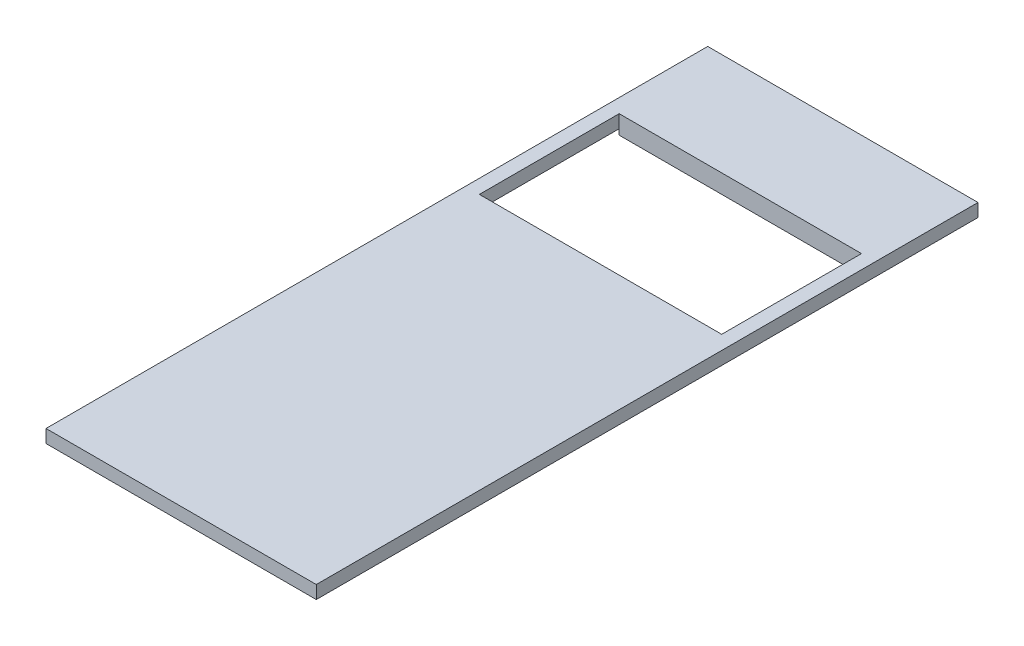
ISO-10303-21;
HEADER;
FILE_DESCRIPTION(('STEP AP214'),'2;1');
FILE_NAME('part.step','',(''),(''),'','','');
FILE_SCHEMA(('AUTOMOTIVE_DESIGN { 1 0 10303 214 1 1 1 1 }'));
ENDSEC;
DATA;
#1=APPLICATION_CONTEXT('core data for automotive mechanical design processes');
#2=APPLICATION_PROTOCOL_DEFINITION('international standard','automotive_design',2000,#1);
#3=PRODUCT_CONTEXT('',#1,'mechanical');
#4=PRODUCT('Part','Part','',(#3));
#5=PRODUCT_RELATED_PRODUCT_CATEGORY('part','',(#4));
#6=PRODUCT_DEFINITION_FORMATION('','',#4);
#7=PRODUCT_DEFINITION_CONTEXT('part definition',#1,'design');
#8=PRODUCT_DEFINITION('design','',#6,#7);
#9=PRODUCT_DEFINITION_SHAPE('','',#8);
#10=(LENGTH_UNIT() NAMED_UNIT(*) SI_UNIT(.MILLI.,.METRE.));
#11=(NAMED_UNIT(*) PLANE_ANGLE_UNIT() SI_UNIT($,.RADIAN.));
#12=(NAMED_UNIT(*) SI_UNIT($,.STERADIAN.) SOLID_ANGLE_UNIT());
#13=UNCERTAINTY_MEASURE_WITH_UNIT(LENGTH_MEASURE(1.E-05),#10,'distance_accuracy_value','');
#14=(GEOMETRIC_REPRESENTATION_CONTEXT(3) GLOBAL_UNCERTAINTY_ASSIGNED_CONTEXT((#13)) GLOBAL_UNIT_ASSIGNED_CONTEXT((#10,
#11,#12)) REPRESENTATION_CONTEXT('',''));
#15=CARTESIAN_POINT('',(0.,0.,0.));
#16=DIRECTION('',(0.,0.,1.));
#17=DIRECTION('',(1.,0.,0.));
#18=AXIS2_PLACEMENT_3D('',#15,#16,#17);
#19=CARTESIAN_POINT('',(1.5,10.9,-69.5));
#20=DIRECTION('',(-1.,0.,0.));
#21=DIRECTION('',(0.,0.,1.));
#22=AXIS2_PLACEMENT_3D('',#19,#20,#21);
#23=PLANE('',#22);
#24=DIRECTION('',(0.,-1.,0.));
#25=VECTOR('',#24,1.);
#26=CARTESIAN_POINT('',(1.49999999999999,26.3,-60.));
#27=LINE('',#26,#25);
#28=CARTESIAN_POINT('',(1.49999999999999,11.5,-60.));
#29=VERTEX_POINT('',#28);
#30=CARTESIAN_POINT('',(1.49999999999999,10.9,-60.));
#31=VERTEX_POINT('',#30);
#32=EDGE_CURVE('E259',#29,#31,#27,.T.);
#33=ORIENTED_EDGE('',*,*,#32,.F.);
#34=DIRECTION('',(0.,0.,1.));
#35=VECTOR('',#34,1.);
#36=CARTESIAN_POINT('',(1.5,11.5,-69.5));
#37=LINE('',#36,#35);
#38=CARTESIAN_POINT('',(1.5,11.5,-69.5));
#39=VERTEX_POINT('',#38);
#40=EDGE_CURVE('E177',#39,#29,#37,.T.);
#41=ORIENTED_EDGE('',*,*,#40,.F.);
#42=DIRECTION('',(0.,1.,0.));
#43=VECTOR('',#42,1.);
#44=CARTESIAN_POINT('',(1.5,10.9,-69.5));
#45=LINE('',#44,#43);
#46=CARTESIAN_POINT('',(1.5,10.9,-69.5));
#47=VERTEX_POINT('',#46);
#48=EDGE_CURVE('E11',#47,#39,#45,.T.);
#49=ORIENTED_EDGE('',*,*,#48,.F.);
#50=DIRECTION('',(0.,0.,1.));
#51=VECTOR('',#50,1.);
#52=CARTESIAN_POINT('',(1.5,10.9,-69.5));
#53=LINE('',#52,#51);
#54=EDGE_CURVE('E227',#47,#31,#53,.T.);
#55=ORIENTED_EDGE('',*,*,#54,.T.);
#56=EDGE_LOOP('',(#33,#41,#49,#55));
#57=FACE_BOUND('',#56,.T.);
#58=ADVANCED_FACE('F39',(#57),#23,.T.);
#59=CARTESIAN_POINT('',(27.5,10.9,-69.5));
#60=DIRECTION('',(1.,0.,0.));
#61=DIRECTION('',(0.,0.,-1.));
#62=AXIS2_PLACEMENT_3D('',#59,#60,#61);
#63=PLANE('',#62);
#64=DIRECTION('',(0.,-1.,0.));
#65=VECTOR('',#64,1.);
#66=CARTESIAN_POINT('',(27.5,26.3,-60.));
#67=LINE('',#66,#65);
#68=CARTESIAN_POINT('',(27.5,11.5,-60.));
#69=VERTEX_POINT('',#68);
#70=CARTESIAN_POINT('',(27.5,10.9,-60.));
#71=VERTEX_POINT('',#70);
#72=EDGE_CURVE('E254',#69,#71,#67,.T.);
#73=ORIENTED_EDGE('',*,*,#72,.T.);
#74=DIRECTION('',(0.,0.,-1.));
#75=VECTOR('',#74,1.);
#76=CARTESIAN_POINT('',(27.5,10.9,-69.5));
#77=LINE('',#76,#75);
#78=CARTESIAN_POINT('',(27.5,10.9,-69.5));
#79=VERTEX_POINT('',#78);
#80=EDGE_CURVE('E167',#71,#79,#77,.T.);
#81=ORIENTED_EDGE('',*,*,#80,.T.);
#82=DIRECTION('',(0.,1.,0.));
#83=VECTOR('',#82,1.);
#84=CARTESIAN_POINT('',(27.5,10.9,-69.5));
#85=LINE('',#84,#83);
#86=CARTESIAN_POINT('',(27.5,11.5,-69.5));
#87=VERTEX_POINT('',#86);
#88=EDGE_CURVE('E49',#79,#87,#85,.T.);
#89=ORIENTED_EDGE('',*,*,#88,.T.);
#90=DIRECTION('',(0.,0.,-1.));
#91=VECTOR('',#90,1.);
#92=CARTESIAN_POINT('',(27.5,11.5,-69.5));
#93=LINE('',#92,#91);
#94=EDGE_CURVE('E187',#69,#87,#93,.T.);
#95=ORIENTED_EDGE('',*,*,#94,.F.);
#96=EDGE_LOOP('',(#73,#81,#89,#95));
#97=FACE_BOUND('',#96,.T.);
#98=ADVANCED_FACE('F242',(#97),#63,.T.);
#99=CARTESIAN_POINT('',(0.,10.9,0.));
#100=DIRECTION('',(0.,1.,0.));
#101=DIRECTION('',(0.,0.,1.));
#102=AXIS2_PLACEMENT_3D('',#99,#100,#101);
#103=PLANE('',#102);
#104=ORIENTED_EDGE('',*,*,#80,.F.);
#105=DIRECTION('',(1.,0.,0.));
#106=VECTOR('',#105,1.);
#107=CARTESIAN_POINT('',(1.49999999999999,10.9,-60.));
#108=LINE('',#107,#106);
#109=EDGE_CURVE('E151',#31,#71,#108,.T.);
#110=ORIENTED_EDGE('',*,*,#109,.F.);
#111=ORIENTED_EDGE('',*,*,#54,.F.);
#112=DIRECTION('',(-1.,0.,0.));
#113=VECTOR('',#112,1.);
#114=CARTESIAN_POINT('',(1.5,10.9,-69.5));
#115=LINE('',#114,#113);
#116=EDGE_CURVE('E166',#79,#47,#115,.T.);
#117=ORIENTED_EDGE('',*,*,#116,.F.);
#118=EDGE_LOOP('',(#104,#110,#111,#117));
#119=FACE_BOUND('',#118,.T.);
#120=ADVANCED_FACE('F249',(#119),#103,.F.);
#121=DIRECTION('',(0.,-1.,0.));
#122=VECTOR('',#121,1.);
#123=CARTESIAN_POINT('',(1.49999999999999,26.3,-45.));
#124=LINE('',#123,#122);
#125=CARTESIAN_POINT('',(1.5,11.5,-45.));
#126=VERTEX_POINT('',#125);
#127=CARTESIAN_POINT('',(1.49999999999999,10.9,-45.));
#128=VERTEX_POINT('',#127);
#129=EDGE_CURVE('E262',#126,#128,#124,.T.);
#130=ORIENTED_EDGE('',*,*,#129,.T.);
#131=CARTESIAN_POINT('',(1.5,10.9,-1.5));
#132=VERTEX_POINT('',#131);
#133=EDGE_CURVE('E160',#128,#132,#53,.T.);
#134=ORIENTED_EDGE('',*,*,#133,.T.);
#135=DIRECTION('',(0.,1.,0.));
#136=VECTOR('',#135,1.);
#137=CARTESIAN_POINT('',(1.5,10.9,-1.5));
#138=LINE('',#137,#136);
#139=CARTESIAN_POINT('',(1.5,11.5,-1.5));
#140=VERTEX_POINT('',#139);
#141=EDGE_CURVE('E43',#132,#140,#138,.T.);
#142=ORIENTED_EDGE('',*,*,#141,.T.);
#143=EDGE_CURVE('E183',#126,#140,#37,.T.);
#144=ORIENTED_EDGE('',*,*,#143,.F.);
#145=EDGE_LOOP('',(#130,#134,#142,#144));
#146=FACE_BOUND('',#145,.T.);
#147=ADVANCED_FACE('F41',(#146),#23,.T.);
#148=CARTESIAN_POINT('',(1.5,10.9,-69.5));
#149=DIRECTION('',(0.,0.,-1.));
#150=DIRECTION('',(-1.,0.,0.));
#151=AXIS2_PLACEMENT_3D('',#148,#149,#150);
#152=PLANE('',#151);
#153=DIRECTION('',(-1.,0.,0.));
#154=VECTOR('',#153,1.);
#155=CARTESIAN_POINT('',(1.5,11.5,-69.5));
#156=LINE('',#155,#154);
#157=EDGE_CURVE('E191',#87,#39,#156,.T.);
#158=ORIENTED_EDGE('',*,*,#157,.F.);
#159=ORIENTED_EDGE('',*,*,#88,.F.);
#160=ORIENTED_EDGE('',*,*,#116,.T.);
#161=ORIENTED_EDGE('',*,*,#48,.T.);
#162=EDGE_LOOP('',(#158,#159,#160,#161));
#163=FACE_BOUND('',#162,.T.);
#164=ADVANCED_FACE('F246',(#163),#152,.T.);
#165=DIRECTION('',(0.,-1.,0.));
#166=VECTOR('',#165,1.);
#167=CARTESIAN_POINT('',(27.5,26.3,-45.));
#168=LINE('',#167,#166);
#169=CARTESIAN_POINT('',(27.5,11.5,-45.));
#170=VERTEX_POINT('',#169);
#171=CARTESIAN_POINT('',(27.5,10.9,-45.));
#172=VERTEX_POINT('',#171);
#173=EDGE_CURVE('E139',#170,#172,#168,.T.);
#174=ORIENTED_EDGE('',*,*,#173,.F.);
#175=CARTESIAN_POINT('',(27.5,11.5,-1.5));
#176=VERTEX_POINT('',#175);
#177=EDGE_CURVE('E188',#176,#170,#93,.T.);
#178=ORIENTED_EDGE('',*,*,#177,.F.);
#179=DIRECTION('',(0.,1.,0.));
#180=VECTOR('',#179,1.);
#181=CARTESIAN_POINT('',(27.5,10.9,-1.5));
#182=LINE('',#181,#180);
#183=CARTESIAN_POINT('',(27.5,10.9,-1.5));
#184=VERTEX_POINT('',#183);
#185=EDGE_CURVE('E164',#184,#176,#182,.T.);
#186=ORIENTED_EDGE('',*,*,#185,.F.);
#187=EDGE_CURVE('E158',#184,#172,#77,.T.);
#188=ORIENTED_EDGE('',*,*,#187,.T.);
#189=EDGE_LOOP('',(#174,#178,#186,#188));
#190=FACE_BOUND('',#189,.T.);
#191=ADVANCED_FACE('F163',(#190),#63,.T.);
#192=CARTESIAN_POINT('',(1.5,10.9,-1.5));
#193=DIRECTION('',(0.,0.,1.));
#194=DIRECTION('',(1.,0.,0.));
#195=AXIS2_PLACEMENT_3D('',#192,#193,#194);
#196=PLANE('',#195);
#197=DIRECTION('',(1.,0.,0.));
#198=VECTOR('',#197,1.);
#199=CARTESIAN_POINT('',(1.5,11.5,-1.5));
#200=LINE('',#199,#198);
#201=EDGE_CURVE('E181',#140,#176,#200,.T.);
#202=ORIENTED_EDGE('',*,*,#201,.F.);
#203=ORIENTED_EDGE('',*,*,#141,.F.);
#204=DIRECTION('',(1.,0.,0.));
#205=VECTOR('',#204,1.);
#206=CARTESIAN_POINT('',(1.5,10.9,-1.5));
#207=LINE('',#206,#205);
#208=EDGE_CURVE('E173',#132,#184,#207,.T.);
#209=ORIENTED_EDGE('',*,*,#208,.T.);
#210=ORIENTED_EDGE('',*,*,#185,.T.);
#211=EDGE_LOOP('',(#202,#203,#209,#210));
#212=FACE_BOUND('',#211,.T.);
#213=ADVANCED_FACE('F207',(#212),#196,.T.);
#214=ORIENTED_EDGE('',*,*,#133,.F.);
#215=DIRECTION('',(-1.,0.,0.));
#216=VECTOR('',#215,1.);
#217=CARTESIAN_POINT('',(1.49999999999999,10.9,-45.));
#218=LINE('',#217,#216);
#219=EDGE_CURVE('E142',#172,#128,#218,.T.);
#220=ORIENTED_EDGE('',*,*,#219,.F.);
#221=ORIENTED_EDGE('',*,*,#187,.F.);
#222=ORIENTED_EDGE('',*,*,#208,.F.);
#223=EDGE_LOOP('',(#214,#220,#221,#222));
#224=FACE_BOUND('',#223,.T.);
#225=ADVANCED_FACE('F156',(#224),#103,.F.);
#226=CARTESIAN_POINT('',(0.,12.9,0.));
#227=DIRECTION('',(1.,0.,0.));
#228=DIRECTION('',(0.,0.,-1.));
#229=AXIS2_PLACEMENT_3D('',#226,#227,#228);
#230=PLANE('',#229);
#231=DIRECTION('',(0.,0.,1.));
#232=VECTOR('',#231,1.);
#233=CARTESIAN_POINT('',(0.,11.5,0.));
#234=LINE('',#233,#232);
#235=CARTESIAN_POINT('',(0.,11.5,-71.));
#236=VERTEX_POINT('',#235);
#237=CARTESIAN_POINT('',(0.,11.5,0.));
#238=VERTEX_POINT('',#237);
#239=EDGE_CURVE('E281',#236,#238,#234,.T.);
#240=ORIENTED_EDGE('',*,*,#239,.T.);
#241=DIRECTION('',(0.,-1.,0.));
#242=VECTOR('',#241,1.);
#243=CARTESIAN_POINT('',(0.,12.9,0.));
#244=LINE('',#243,#242);
#245=CARTESIAN_POINT('',(0.,12.9,0.));
#246=VERTEX_POINT('',#245);
#247=EDGE_CURVE('E213',#246,#238,#244,.T.);
#248=ORIENTED_EDGE('',*,*,#247,.F.);
#249=DIRECTION('',(0.,0.,1.));
#250=VECTOR('',#249,1.);
#251=CARTESIAN_POINT('',(0.,12.9,0.));
#252=LINE('',#251,#250);
#253=CARTESIAN_POINT('',(0.,12.9,-71.));
#254=VERTEX_POINT('',#253);
#255=EDGE_CURVE('E282',#254,#246,#252,.T.);
#256=ORIENTED_EDGE('',*,*,#255,.F.);
#257=DIRECTION('',(0.,-1.,0.));
#258=VECTOR('',#257,1.);
#259=CARTESIAN_POINT('',(0.,12.9,-71.));
#260=LINE('',#259,#258);
#261=EDGE_CURVE('E296',#254,#236,#260,.T.);
#262=ORIENTED_EDGE('',*,*,#261,.T.);
#263=EDGE_LOOP('',(#240,#248,#256,#262));
#264=FACE_BOUND('',#263,.T.);
#265=ADVANCED_FACE('F322',(#264),#230,.F.);
#266=CARTESIAN_POINT('',(0.,12.9,0.));
#267=DIRECTION('',(0.,0.,-1.));
#268=DIRECTION('',(-1.,0.,0.));
#269=AXIS2_PLACEMENT_3D('',#266,#267,#268);
#270=PLANE('',#269);
#271=DIRECTION('',(1.,0.,0.));
#272=VECTOR('',#271,1.);
#273=CARTESIAN_POINT('',(0.,11.5,0.));
#274=LINE('',#273,#272);
#275=CARTESIAN_POINT('',(29.,11.5,0.));
#276=VERTEX_POINT('',#275);
#277=EDGE_CURVE('E299',#238,#276,#274,.T.);
#278=ORIENTED_EDGE('',*,*,#277,.T.);
#279=DIRECTION('',(0.,-1.,0.));
#280=VECTOR('',#279,1.);
#281=CARTESIAN_POINT('',(29.,12.9,0.));
#282=LINE('',#281,#280);
#283=CARTESIAN_POINT('',(29.,12.9,0.));
#284=VERTEX_POINT('',#283);
#285=EDGE_CURVE('E217',#284,#276,#282,.T.);
#286=ORIENTED_EDGE('',*,*,#285,.F.);
#287=DIRECTION('',(1.,0.,0.));
#288=VECTOR('',#287,1.);
#289=CARTESIAN_POINT('',(0.,12.9,0.));
#290=LINE('',#289,#288);
#291=EDGE_CURVE('E286',#246,#284,#290,.T.);
#292=ORIENTED_EDGE('',*,*,#291,.F.);
#293=ORIENTED_EDGE('',*,*,#247,.T.);
#294=EDGE_LOOP('',(#278,#286,#292,#293));
#295=FACE_BOUND('',#294,.T.);
#296=ADVANCED_FACE('F328',(#295),#270,.F.);
#297=CARTESIAN_POINT('',(29.,12.9,0.));
#298=DIRECTION('',(-1.,0.,0.));
#299=DIRECTION('',(0.,0.,1.));
#300=AXIS2_PLACEMENT_3D('',#297,#298,#299);
#301=PLANE('',#300);
#302=DIRECTION('',(0.,0.,-1.));
#303=VECTOR('',#302,1.);
#304=CARTESIAN_POINT('',(29.,11.5,0.));
#305=LINE('',#304,#303);
#306=CARTESIAN_POINT('',(29.,11.5,-71.));
#307=VERTEX_POINT('',#306);
#308=EDGE_CURVE('E302',#276,#307,#305,.T.);
#309=ORIENTED_EDGE('',*,*,#308,.T.);
#310=DIRECTION('',(0.,-1.,0.));
#311=VECTOR('',#310,1.);
#312=CARTESIAN_POINT('',(29.,12.9,-71.));
#313=LINE('',#312,#311);
#314=CARTESIAN_POINT('',(29.,12.9,-71.));
#315=VERTEX_POINT('',#314);
#316=EDGE_CURVE('E224',#315,#307,#313,.T.);
#317=ORIENTED_EDGE('',*,*,#316,.F.);
#318=DIRECTION('',(0.,0.,-1.));
#319=VECTOR('',#318,1.);
#320=CARTESIAN_POINT('',(29.,12.9,0.));
#321=LINE('',#320,#319);
#322=EDGE_CURVE('E290',#284,#315,#321,.T.);
#323=ORIENTED_EDGE('',*,*,#322,.F.);
#324=ORIENTED_EDGE('',*,*,#285,.T.);
#325=EDGE_LOOP('',(#309,#317,#323,#324));
#326=FACE_BOUND('',#325,.T.);
#327=ADVANCED_FACE('F327',(#326),#301,.F.);
#328=CARTESIAN_POINT('',(0.,12.9,-71.));
#329=DIRECTION('',(0.,0.,1.));
#330=DIRECTION('',(1.,0.,0.));
#331=AXIS2_PLACEMENT_3D('',#328,#329,#330);
#332=PLANE('',#331);
#333=DIRECTION('',(-1.,0.,0.));
#334=VECTOR('',#333,1.);
#335=CARTESIAN_POINT('',(0.,11.5,-71.));
#336=LINE('',#335,#334);
#337=EDGE_CURVE('E287',#307,#236,#336,.T.);
#338=ORIENTED_EDGE('',*,*,#337,.T.);
#339=ORIENTED_EDGE('',*,*,#261,.F.);
#340=DIRECTION('',(-1.,0.,0.));
#341=VECTOR('',#340,1.);
#342=CARTESIAN_POINT('',(0.,12.9,-71.));
#343=LINE('',#342,#341);
#344=EDGE_CURVE('E293',#315,#254,#343,.T.);
#345=ORIENTED_EDGE('',*,*,#344,.F.);
#346=ORIENTED_EDGE('',*,*,#316,.T.);
#347=EDGE_LOOP('',(#338,#339,#345,#346));
#348=FACE_BOUND('',#347,.T.);
#349=ADVANCED_FACE('F315',(#348),#332,.F.);
#350=CARTESIAN_POINT('',(0.,12.9,0.));
#351=DIRECTION('',(0.,-1.,0.));
#352=DIRECTION('',(0.,0.,-1.));
#353=AXIS2_PLACEMENT_3D('',#350,#351,#352);
#354=PLANE('',#353);
#355=DIRECTION('',(1.,0.,0.));
#356=VECTOR('',#355,1.);
#357=CARTESIAN_POINT('',(0.,12.9,-60.));
#358=LINE('',#357,#356);
#359=CARTESIAN_POINT('',(1.49999999999999,12.9,-60.));
#360=VERTEX_POINT('',#359);
#361=CARTESIAN_POINT('',(27.5,12.9,-60.));
#362=VERTEX_POINT('',#361);
#363=EDGE_CURVE('E273',#360,#362,#358,.T.);
#364=ORIENTED_EDGE('',*,*,#363,.T.);
#365=DIRECTION('',(0.,0.,1.));
#366=VECTOR('',#365,1.);
#367=CARTESIAN_POINT('',(27.5,12.9,0.));
#368=LINE('',#367,#366);
#369=CARTESIAN_POINT('',(27.5,12.9,-45.));
#370=VERTEX_POINT('',#369);
#371=EDGE_CURVE('E277',#362,#370,#368,.T.);
#372=ORIENTED_EDGE('',*,*,#371,.T.);
#373=DIRECTION('',(-1.,0.,0.));
#374=VECTOR('',#373,1.);
#375=CARTESIAN_POINT('',(0.,12.9,-45.));
#376=LINE('',#375,#374);
#377=CARTESIAN_POINT('',(1.49999999999999,12.9,-45.));
#378=VERTEX_POINT('',#377);
#379=EDGE_CURVE('E265',#370,#378,#376,.T.);
#380=ORIENTED_EDGE('',*,*,#379,.T.);
#381=DIRECTION('',(0.,0.,-1.));
#382=VECTOR('',#381,1.);
#383=CARTESIAN_POINT('',(1.49999999999999,12.9,0.));
#384=LINE('',#383,#382);
#385=EDGE_CURVE('E269',#378,#360,#384,.T.);
#386=ORIENTED_EDGE('',*,*,#385,.T.);
#387=EDGE_LOOP('',(#364,#372,#380,#386));
#388=FACE_BOUND('',#387,.T.);
#389=ORIENTED_EDGE('',*,*,#255,.T.);
#390=ORIENTED_EDGE('',*,*,#291,.T.);
#391=ORIENTED_EDGE('',*,*,#322,.T.);
#392=ORIENTED_EDGE('',*,*,#344,.T.);
#393=EDGE_LOOP('',(#389,#390,#391,#392));
#394=FACE_BOUND('',#393,.T.);
#395=ADVANCED_FACE('F325',(#388,#394),#354,.F.);
#396=CARTESIAN_POINT('',(0.,11.5,0.));
#397=DIRECTION('',(0.,-1.,0.));
#398=DIRECTION('',(0.,0.,-1.));
#399=AXIS2_PLACEMENT_3D('',#396,#397,#398);
#400=PLANE('',#399);
#401=ORIENTED_EDGE('',*,*,#157,.T.);
#402=ORIENTED_EDGE('',*,*,#40,.T.);
#403=EDGE_CURVE('E182',#29,#126,#37,.T.);
#404=ORIENTED_EDGE('',*,*,#403,.T.);
#405=ORIENTED_EDGE('',*,*,#143,.T.);
#406=ORIENTED_EDGE('',*,*,#201,.T.);
#407=ORIENTED_EDGE('',*,*,#177,.T.);
#408=EDGE_CURVE('E192',#170,#69,#93,.T.);
#409=ORIENTED_EDGE('',*,*,#408,.T.);
#410=ORIENTED_EDGE('',*,*,#94,.T.);
#411=EDGE_LOOP('',(#401,#402,#404,#405,#406,#407,#409,#410));
#412=FACE_BOUND('',#411,.T.);
#413=ORIENTED_EDGE('',*,*,#239,.F.);
#414=ORIENTED_EDGE('',*,*,#337,.F.);
#415=ORIENTED_EDGE('',*,*,#308,.F.);
#416=ORIENTED_EDGE('',*,*,#277,.F.);
#417=EDGE_LOOP('',(#413,#414,#415,#416));
#418=FACE_BOUND('',#417,.T.);
#419=ADVANCED_FACE('F209',(#412,#418),#400,.T.);
#420=CARTESIAN_POINT('',(27.5,26.3,-45.));
#421=DIRECTION('',(1.,0.,0.));
#422=DIRECTION('',(0.,0.,-1.));
#423=AXIS2_PLACEMENT_3D('',#420,#421,#422);
#424=PLANE('',#423);
#425=EDGE_CURVE('E257',#362,#69,#67,.T.);
#426=ORIENTED_EDGE('',*,*,#425,.T.);
#427=ORIENTED_EDGE('',*,*,#408,.F.);
#428=EDGE_CURVE('E145',#370,#170,#168,.T.);
#429=ORIENTED_EDGE('',*,*,#428,.F.);
#430=ORIENTED_EDGE('',*,*,#371,.F.);
#431=EDGE_LOOP('',(#426,#427,#429,#430));
#432=FACE_BOUND('',#431,.T.);
#433=ADVANCED_FACE('F423',(#432),#424,.F.);
#434=CARTESIAN_POINT('',(1.49999999999999,26.3,-60.));
#435=DIRECTION('',(0.,0.,-1.));
#436=DIRECTION('',(-1.,0.,0.));
#437=AXIS2_PLACEMENT_3D('',#434,#435,#436);
#438=PLANE('',#437);
#439=EDGE_CURVE('E258',#360,#29,#27,.T.);
#440=ORIENTED_EDGE('',*,*,#439,.T.);
#441=ORIENTED_EDGE('',*,*,#32,.T.);
#442=ORIENTED_EDGE('',*,*,#109,.T.);
#443=ORIENTED_EDGE('',*,*,#72,.F.);
#444=ORIENTED_EDGE('',*,*,#425,.F.);
#445=ORIENTED_EDGE('',*,*,#363,.F.);
#446=EDGE_LOOP('',(#440,#441,#442,#443,#444,#445));
#447=FACE_BOUND('',#446,.T.);
#448=ADVANCED_FACE('F441',(#447),#438,.F.);
#449=CARTESIAN_POINT('',(1.49999999999999,26.3,-45.));
#450=DIRECTION('',(-1.,0.,0.));
#451=DIRECTION('',(0.,0.,1.));
#452=AXIS2_PLACEMENT_3D('',#449,#450,#451);
#453=PLANE('',#452);
#454=EDGE_CURVE('E57',#378,#126,#124,.T.);
#455=ORIENTED_EDGE('',*,*,#454,.T.);
#456=ORIENTED_EDGE('',*,*,#403,.F.);
#457=ORIENTED_EDGE('',*,*,#439,.F.);
#458=ORIENTED_EDGE('',*,*,#385,.F.);
#459=EDGE_LOOP('',(#455,#456,#457,#458));
#460=FACE_BOUND('',#459,.T.);
#461=ADVANCED_FACE('F448',(#460),#453,.F.);
#462=CARTESIAN_POINT('',(1.49999999999999,26.3,-45.));
#463=DIRECTION('',(0.,0.,1.));
#464=DIRECTION('',(1.,0.,0.));
#465=AXIS2_PLACEMENT_3D('',#462,#463,#464);
#466=PLANE('',#465);
#467=ORIENTED_EDGE('',*,*,#428,.T.);
#468=ORIENTED_EDGE('',*,*,#173,.T.);
#469=ORIENTED_EDGE('',*,*,#219,.T.);
#470=ORIENTED_EDGE('',*,*,#129,.F.);
#471=ORIENTED_EDGE('',*,*,#454,.F.);
#472=ORIENTED_EDGE('',*,*,#379,.F.);
#473=EDGE_LOOP('',(#467,#468,#469,#470,#471,#472));
#474=FACE_BOUND('',#473,.T.);
#475=ADVANCED_FACE('F141',(#474),#466,.F.);
#476=CLOSED_SHELL('',(#58,#98,#120,#147,#164,#191,#213,#225,#265,#296,#327,#349,#395,#419,#433,
#448,#461,#475));
#477=MANIFOLD_SOLID_BREP('B2',#476);
#478=ADVANCED_BREP_SHAPE_REPRESENTATION('',(#18,#477),#14);
#479=SHAPE_DEFINITION_REPRESENTATION(#9,#478);
ENDSEC;
END-ISO-10303-21;
